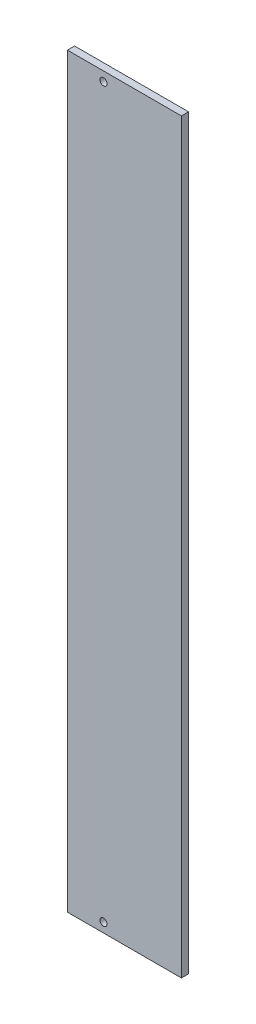
ISO-10303-21;
HEADER;
FILE_DESCRIPTION(('STEP AP214'),'2;1');
FILE_NAME('part.step','',(''),(''),'','','');
FILE_SCHEMA(('AUTOMOTIVE_DESIGN { 1 0 10303 214 1 1 1 1 }'));
ENDSEC;
DATA;
#1=APPLICATION_CONTEXT('core data for automotive mechanical design processes');
#2=APPLICATION_PROTOCOL_DEFINITION('international standard','automotive_design',2000,#1);
#3=PRODUCT_CONTEXT('',#1,'mechanical');
#4=PRODUCT('Part','Part','',(#3));
#5=PRODUCT_RELATED_PRODUCT_CATEGORY('part','',(#4));
#6=PRODUCT_DEFINITION_FORMATION('','',#4);
#7=PRODUCT_DEFINITION_CONTEXT('part definition',#1,'design');
#8=PRODUCT_DEFINITION('design','',#6,#7);
#9=PRODUCT_DEFINITION_SHAPE('','',#8);
#10=(LENGTH_UNIT() NAMED_UNIT(*) SI_UNIT(.MILLI.,.METRE.));
#11=(NAMED_UNIT(*) PLANE_ANGLE_UNIT() SI_UNIT($,.RADIAN.));
#12=(NAMED_UNIT(*) SI_UNIT($,.STERADIAN.) SOLID_ANGLE_UNIT());
#13=UNCERTAINTY_MEASURE_WITH_UNIT(LENGTH_MEASURE(1.E-05),#10,'distance_accuracy_value','');
#14=(GEOMETRIC_REPRESENTATION_CONTEXT(3) GLOBAL_UNCERTAINTY_ASSIGNED_CONTEXT((#13)) GLOBAL_UNIT_ASSIGNED_CONTEXT((#10,
#11,#12)) REPRESENTATION_CONTEXT('',''));
#15=CARTESIAN_POINT('',(0.,0.,0.));
#16=DIRECTION('',(0.,0.,1.));
#17=DIRECTION('',(1.,0.,0.));
#18=AXIS2_PLACEMENT_3D('',#15,#16,#17);
#19=CARTESIAN_POINT('',(0.,0.,2.5));
#20=DIRECTION('',(0.,0.,-1.));
#21=DIRECTION('',(-1.,0.,0.));
#22=AXIS2_PLACEMENT_3D('',#19,#20,#21);
#23=PLANE('',#22);
#24=CARTESIAN_POINT('',(12.65,258.7,2.5));
#25=DIRECTION('',(0.,0.,1.));
#26=DIRECTION('',(1.,0.,0.));
#27=AXIS2_PLACEMENT_3D('',#24,#25,#26);
#28=CIRCLE('',#27,1.25);
#29=CARTESIAN_POINT('',(13.9,258.7,2.5));
#30=VERTEX_POINT('',#29);
#31=EDGE_CURVE('E100',#30,#30,#28,.T.);
#32=ORIENTED_EDGE('',*,*,#31,.F.);
#33=EDGE_LOOP('',(#32));
#34=FACE_BOUND('',#33,.T.);
#35=DIRECTION('',(0.,-1.,0.));
#36=VECTOR('',#35,1.);
#37=CARTESIAN_POINT('',(0.,0.,2.5));
#38=LINE('',#37,#36);
#39=CARTESIAN_POINT('',(0.,262.,2.5));
#40=VERTEX_POINT('',#39);
#41=CARTESIAN_POINT('',(0.,0.,2.5));
#42=VERTEX_POINT('',#41);
#43=EDGE_CURVE('E85',#40,#42,#38,.T.);
#44=ORIENTED_EDGE('',*,*,#43,.T.);
#45=DIRECTION('',(1.,0.,0.));
#46=VECTOR('',#45,1.);
#47=CARTESIAN_POINT('',(0.,0.,2.5));
#48=LINE('',#47,#46);
#49=CARTESIAN_POINT('',(40.,0.,2.5));
#50=VERTEX_POINT('',#49);
#51=EDGE_CURVE('E80',#42,#50,#48,.T.);
#52=ORIENTED_EDGE('',*,*,#51,.T.);
#53=DIRECTION('',(0.,1.,0.));
#54=VECTOR('',#53,1.);
#55=CARTESIAN_POINT('',(40.,0.,2.5));
#56=LINE('',#55,#54);
#57=CARTESIAN_POINT('',(40.,262.,2.5));
#58=VERTEX_POINT('',#57);
#59=EDGE_CURVE('E83',#50,#58,#56,.T.);
#60=ORIENTED_EDGE('',*,*,#59,.T.);
#61=DIRECTION('',(-1.,0.,0.));
#62=VECTOR('',#61,1.);
#63=CARTESIAN_POINT('',(0.,262.,2.5));
#64=LINE('',#63,#62);
#65=EDGE_CURVE('E50',#58,#40,#64,.T.);
#66=ORIENTED_EDGE('',*,*,#65,.T.);
#67=EDGE_LOOP('',(#44,#52,#60,#66));
#68=FACE_BOUND('',#67,.T.);
#69=CARTESIAN_POINT('',(12.65,3.3,2.5));
#70=DIRECTION('',(0.,0.,1.));
#71=DIRECTION('',(1.,0.,0.));
#72=AXIS2_PLACEMENT_3D('',#69,#70,#71);
#73=CIRCLE('',#72,1.25);
#74=CARTESIAN_POINT('',(13.9,3.3,2.5));
#75=VERTEX_POINT('',#74);
#76=EDGE_CURVE('E115',#75,#75,#73,.T.);
#77=ORIENTED_EDGE('',*,*,#76,.F.);
#78=EDGE_LOOP('',(#77));
#79=FACE_BOUND('',#78,.T.);
#80=ADVANCED_FACE('F33',(#34,#68,#79),#23,.F.);
#81=CARTESIAN_POINT('',(0.,0.,0.));
#82=DIRECTION('',(0.,0.,-1.));
#83=DIRECTION('',(-1.,0.,0.));
#84=AXIS2_PLACEMENT_3D('',#81,#82,#83);
#85=PLANE('',#84);
#86=CARTESIAN_POINT('',(12.65,258.7,0.));
#87=DIRECTION('',(0.,0.,1.));
#88=DIRECTION('',(1.,0.,0.));
#89=AXIS2_PLACEMENT_3D('',#86,#87,#88);
#90=CIRCLE('',#89,1.25);
#91=CARTESIAN_POINT('',(13.9,258.7,0.));
#92=VERTEX_POINT('',#91);
#93=EDGE_CURVE('E112',#92,#92,#90,.T.);
#94=ORIENTED_EDGE('',*,*,#93,.T.);
#95=EDGE_LOOP('',(#94));
#96=FACE_BOUND('',#95,.T.);
#97=DIRECTION('',(0.,-1.,0.));
#98=VECTOR('',#97,1.);
#99=CARTESIAN_POINT('',(0.,0.,0.));
#100=LINE('',#99,#98);
#101=CARTESIAN_POINT('',(0.,262.,0.));
#102=VERTEX_POINT('',#101);
#103=CARTESIAN_POINT('',(0.,0.,0.));
#104=VERTEX_POINT('',#103);
#105=EDGE_CURVE('E97',#102,#104,#100,.T.);
#106=ORIENTED_EDGE('',*,*,#105,.F.);
#107=DIRECTION('',(-1.,0.,0.));
#108=VECTOR('',#107,1.);
#109=CARTESIAN_POINT('',(0.,262.,0.));
#110=LINE('',#109,#108);
#111=CARTESIAN_POINT('',(40.,262.,0.));
#112=VERTEX_POINT('',#111);
#113=EDGE_CURVE('E73',#112,#102,#110,.T.);
#114=ORIENTED_EDGE('',*,*,#113,.F.);
#115=DIRECTION('',(0.,1.,0.));
#116=VECTOR('',#115,1.);
#117=CARTESIAN_POINT('',(40.,0.,0.));
#118=LINE('',#117,#116);
#119=CARTESIAN_POINT('',(40.,0.,0.));
#120=VERTEX_POINT('',#119);
#121=EDGE_CURVE('E67',#120,#112,#118,.T.);
#122=ORIENTED_EDGE('',*,*,#121,.F.);
#123=DIRECTION('',(1.,0.,0.));
#124=VECTOR('',#123,1.);
#125=CARTESIAN_POINT('',(0.,0.,0.));
#126=LINE('',#125,#124);
#127=EDGE_CURVE('E89',#104,#120,#126,.T.);
#128=ORIENTED_EDGE('',*,*,#127,.F.);
#129=EDGE_LOOP('',(#106,#114,#122,#128));
#130=FACE_BOUND('',#129,.T.);
#131=CARTESIAN_POINT('',(12.65,3.3,0.));
#132=DIRECTION('',(0.,0.,1.));
#133=DIRECTION('',(1.,0.,0.));
#134=AXIS2_PLACEMENT_3D('',#131,#132,#133);
#135=CIRCLE('',#134,1.25);
#136=CARTESIAN_POINT('',(13.9,3.3,0.));
#137=VERTEX_POINT('',#136);
#138=EDGE_CURVE('E118',#137,#137,#135,.T.);
#139=ORIENTED_EDGE('',*,*,#138,.T.);
#140=EDGE_LOOP('',(#139));
#141=FACE_BOUND('',#140,.T.);
#142=ADVANCED_FACE('F108',(#96,#130,#141),#85,.T.);
#143=CARTESIAN_POINT('',(0.,0.,2.5));
#144=DIRECTION('',(1.,0.,0.));
#145=DIRECTION('',(0.,0.,-1.));
#146=AXIS2_PLACEMENT_3D('',#143,#144,#145);
#147=PLANE('',#146);
#148=ORIENTED_EDGE('',*,*,#105,.T.);
#149=DIRECTION('',(0.,0.,-1.));
#150=VECTOR('',#149,1.);
#151=CARTESIAN_POINT('',(0.,0.,2.5));
#152=LINE('',#151,#150);
#153=EDGE_CURVE('E11',#42,#104,#152,.T.);
#154=ORIENTED_EDGE('',*,*,#153,.F.);
#155=ORIENTED_EDGE('',*,*,#43,.F.);
#156=DIRECTION('',(0.,0.,-1.));
#157=VECTOR('',#156,1.);
#158=CARTESIAN_POINT('',(0.,262.,2.5));
#159=LINE('',#158,#157);
#160=EDGE_CURVE('E93',#40,#102,#159,.T.);
#161=ORIENTED_EDGE('',*,*,#160,.T.);
#162=EDGE_LOOP('',(#148,#154,#155,#161));
#163=FACE_BOUND('',#162,.T.);
#164=ADVANCED_FACE('F35',(#163),#147,.F.);
#165=CARTESIAN_POINT('',(0.,0.,2.5));
#166=DIRECTION('',(0.,1.,0.));
#167=DIRECTION('',(0.,0.,1.));
#168=AXIS2_PLACEMENT_3D('',#165,#166,#167);
#169=PLANE('',#168);
#170=ORIENTED_EDGE('',*,*,#127,.T.);
#171=DIRECTION('',(0.,0.,-1.));
#172=VECTOR('',#171,1.);
#173=CARTESIAN_POINT('',(40.,0.,2.5));
#174=LINE('',#173,#172);
#175=EDGE_CURVE('E42',#50,#120,#174,.T.);
#176=ORIENTED_EDGE('',*,*,#175,.F.);
#177=ORIENTED_EDGE('',*,*,#51,.F.);
#178=ORIENTED_EDGE('',*,*,#153,.T.);
#179=EDGE_LOOP('',(#170,#176,#177,#178));
#180=FACE_BOUND('',#179,.T.);
#181=ADVANCED_FACE('F88',(#180),#169,.F.);
#182=CARTESIAN_POINT('',(40.,0.,2.5));
#183=DIRECTION('',(-1.,0.,0.));
#184=DIRECTION('',(0.,0.,1.));
#185=AXIS2_PLACEMENT_3D('',#182,#183,#184);
#186=PLANE('',#185);
#187=ORIENTED_EDGE('',*,*,#121,.T.);
#188=DIRECTION('',(0.,0.,-1.));
#189=VECTOR('',#188,1.);
#190=CARTESIAN_POINT('',(40.,262.,2.5));
#191=LINE('',#190,#189);
#192=EDGE_CURVE('E90',#58,#112,#191,.T.);
#193=ORIENTED_EDGE('',*,*,#192,.F.);
#194=ORIENTED_EDGE('',*,*,#59,.F.);
#195=ORIENTED_EDGE('',*,*,#175,.T.);
#196=EDGE_LOOP('',(#187,#193,#194,#195));
#197=FACE_BOUND('',#196,.T.);
#198=ADVANCED_FACE('F91',(#197),#186,.F.);
#199=CARTESIAN_POINT('',(0.,262.,2.5));
#200=DIRECTION('',(0.,-1.,0.));
#201=DIRECTION('',(0.,0.,-1.));
#202=AXIS2_PLACEMENT_3D('',#199,#200,#201);
#203=PLANE('',#202);
#204=ORIENTED_EDGE('',*,*,#113,.T.);
#205=ORIENTED_EDGE('',*,*,#160,.F.);
#206=ORIENTED_EDGE('',*,*,#65,.F.);
#207=ORIENTED_EDGE('',*,*,#192,.T.);
#208=EDGE_LOOP('',(#204,#205,#206,#207));
#209=FACE_BOUND('',#208,.T.);
#210=ADVANCED_FACE('F105',(#209),#203,.F.);
#211=CARTESIAN_POINT('',(12.65,258.7,2.5));
#212=DIRECTION('',(0.,0.,-1.));
#213=DIRECTION('',(-1.,0.,0.));
#214=AXIS2_PLACEMENT_3D('',#211,#212,#213);
#215=CYLINDRICAL_SURFACE('',#214,1.25);
#216=ORIENTED_EDGE('',*,*,#31,.T.);
#217=EDGE_LOOP('',(#216));
#218=FACE_BOUND('',#217,.T.);
#219=ORIENTED_EDGE('',*,*,#93,.F.);
#220=EDGE_LOOP('',(#219));
#221=FACE_BOUND('',#220,.T.);
#222=ADVANCED_FACE('F136',(#218,#221),#215,.F.);
#223=CARTESIAN_POINT('',(12.65,3.3,2.5));
#224=DIRECTION('',(0.,0.,-1.));
#225=DIRECTION('',(-1.,0.,0.));
#226=AXIS2_PLACEMENT_3D('',#223,#224,#225);
#227=CYLINDRICAL_SURFACE('',#226,1.25);
#228=ORIENTED_EDGE('',*,*,#76,.T.);
#229=EDGE_LOOP('',(#228));
#230=FACE_BOUND('',#229,.T.);
#231=ORIENTED_EDGE('',*,*,#138,.F.);
#232=EDGE_LOOP('',(#231));
#233=FACE_BOUND('',#232,.T.);
#234=ADVANCED_FACE('F124',(#230,#233),#227,.F.);
#235=CLOSED_SHELL('',(#80,#142,#164,#181,#198,#210,#222,#234));
#236=MANIFOLD_SOLID_BREP('B2',#235);
#237=ADVANCED_BREP_SHAPE_REPRESENTATION('',(#18,#236),#14);
#238=SHAPE_DEFINITION_REPRESENTATION(#9,#237);
ENDSEC;
END-ISO-10303-21;
